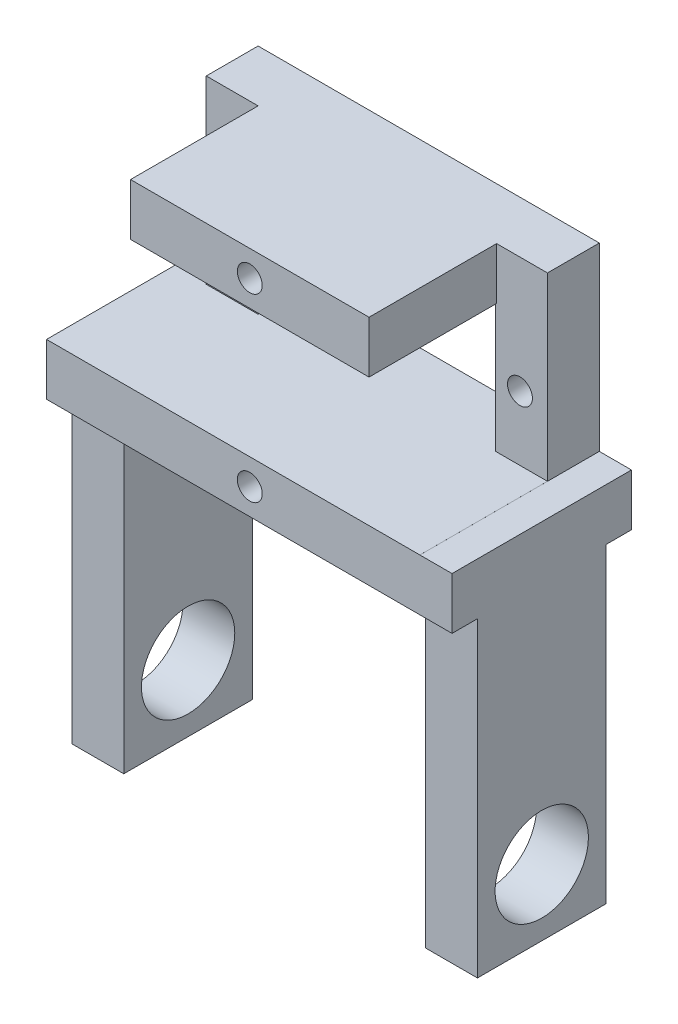
ISO-10303-21;
HEADER;
FILE_DESCRIPTION(('STEP AP214'),'2;1');
FILE_NAME('part.step','',(''),(''),'','','');
FILE_SCHEMA(('AUTOMOTIVE_DESIGN { 1 0 10303 214 1 1 1 1 }'));
ENDSEC;
DATA;
#1=APPLICATION_CONTEXT('core data for automotive mechanical design processes');
#2=APPLICATION_PROTOCOL_DEFINITION('international standard','automotive_design',2000,#1);
#3=PRODUCT_CONTEXT('',#1,'mechanical');
#4=PRODUCT('Part','Part','',(#3));
#5=PRODUCT_RELATED_PRODUCT_CATEGORY('part','',(#4));
#6=PRODUCT_DEFINITION_FORMATION('','',#4);
#7=PRODUCT_DEFINITION_CONTEXT('part definition',#1,'design');
#8=PRODUCT_DEFINITION('design','',#6,#7);
#9=PRODUCT_DEFINITION_SHAPE('','',#8);
#10=(LENGTH_UNIT() NAMED_UNIT(*) SI_UNIT(.MILLI.,.METRE.));
#11=(NAMED_UNIT(*) PLANE_ANGLE_UNIT() SI_UNIT($,.RADIAN.));
#12=(NAMED_UNIT(*) SI_UNIT($,.STERADIAN.) SOLID_ANGLE_UNIT());
#13=UNCERTAINTY_MEASURE_WITH_UNIT(LENGTH_MEASURE(1.E-05),#10,'distance_accuracy_value','');
#14=(GEOMETRIC_REPRESENTATION_CONTEXT(3) GLOBAL_UNCERTAINTY_ASSIGNED_CONTEXT((#13)) GLOBAL_UNIT_ASSIGNED_CONTEXT((#10,
#11,#12)) REPRESENTATION_CONTEXT('',''));
#15=CARTESIAN_POINT('',(0.,0.,0.));
#16=DIRECTION('',(0.,0.,1.));
#17=DIRECTION('',(1.,0.,0.));
#18=AXIS2_PLACEMENT_3D('',#15,#16,#17);
#19=CARTESIAN_POINT('',(-16.45,-11.2,5.));
#20=DIRECTION('',(0.,1.,0.));
#21=DIRECTION('',(0.,0.,1.));
#22=AXIS2_PLACEMENT_3D('',#19,#20,#21);
#23=PLANE('',#22);
#24=DIRECTION('',(-1.,0.,0.));
#25=VECTOR('',#24,1.);
#26=CARTESIAN_POINT('',(14.55,-11.2,14.85));
#27=LINE('',#26,#25);
#28=CARTESIAN_POINT('',(19.55,-11.2,14.85));
#29=VERTEX_POINT('',#28);
#30=CARTESIAN_POINT('',(14.55,-11.2,14.85));
#31=VERTEX_POINT('',#30);
#32=EDGE_CURVE('E475',#29,#31,#27,.T.);
#33=ORIENTED_EDGE('',*,*,#32,.F.);
#34=DIRECTION('',(0.,0.,-1.));
#35=VECTOR('',#34,1.);
#36=CARTESIAN_POINT('',(19.55,-11.2,17.3));
#37=LINE('',#36,#35);
#38=CARTESIAN_POINT('',(19.55,-11.2,17.3));
#39=VERTEX_POINT('',#38);
#40=EDGE_CURVE('E224',#39,#29,#37,.T.);
#41=ORIENTED_EDGE('',*,*,#40,.F.);
#42=DIRECTION('',(1.,0.,0.));
#43=VECTOR('',#42,1.);
#44=CARTESIAN_POINT('',(-11.45,-11.2,17.3));
#45=LINE('',#44,#43);
#46=CARTESIAN_POINT('',(-19.55,-11.2,17.3));
#47=VERTEX_POINT('',#46);
#48=EDGE_CURVE('E310',#47,#39,#45,.T.);
#49=ORIENTED_EDGE('',*,*,#48,.F.);
#50=DIRECTION('',(0.,0.,1.));
#51=VECTOR('',#50,1.);
#52=CARTESIAN_POINT('',(-19.55,-11.2,0.));
#53=LINE('',#52,#51);
#54=CARTESIAN_POINT('',(-19.55,-11.2,14.85));
#55=VERTEX_POINT('',#54);
#56=EDGE_CURVE('E260',#55,#47,#53,.T.);
#57=ORIENTED_EDGE('',*,*,#56,.F.);
#58=DIRECTION('',(-1.,0.,0.));
#59=VECTOR('',#58,1.);
#60=CARTESIAN_POINT('',(-14.55,-11.2,14.85));
#61=LINE('',#60,#59);
#62=CARTESIAN_POINT('',(-14.55,-11.2,14.85));
#63=VERTEX_POINT('',#62);
#64=EDGE_CURVE('E61',#63,#55,#61,.T.);
#65=ORIENTED_EDGE('',*,*,#64,.F.);
#66=DIRECTION('',(0.,0.,1.));
#67=VECTOR('',#66,1.);
#68=CARTESIAN_POINT('',(-14.55,-11.2,2.45));
#69=LINE('',#68,#67);
#70=CARTESIAN_POINT('',(-14.55,-11.2,2.45));
#71=VERTEX_POINT('',#70);
#72=EDGE_CURVE('E228',#71,#63,#69,.T.);
#73=ORIENTED_EDGE('',*,*,#72,.F.);
#74=DIRECTION('',(1.,0.,0.));
#75=VECTOR('',#74,1.);
#76=CARTESIAN_POINT('',(-14.55,-11.2,2.45));
#77=LINE('',#76,#75);
#78=CARTESIAN_POINT('',(-19.55,-11.2,2.45));
#79=VERTEX_POINT('',#78);
#80=EDGE_CURVE('E225',#79,#71,#77,.T.);
#81=ORIENTED_EDGE('',*,*,#80,.F.);
#82=CARTESIAN_POINT('',(-19.55,-11.2,0.));
#83=VERTEX_POINT('',#82);
#84=EDGE_CURVE('E261',#83,#79,#53,.T.);
#85=ORIENTED_EDGE('',*,*,#84,.F.);
#86=DIRECTION('',(1.,0.,0.));
#87=VECTOR('',#86,1.);
#88=CARTESIAN_POINT('',(-16.45,-11.2,0.));
#89=LINE('',#88,#87);
#90=CARTESIAN_POINT('',(19.55,-11.2,0.));
#91=VERTEX_POINT('',#90);
#92=EDGE_CURVE('E390',#83,#91,#89,.T.);
#93=ORIENTED_EDGE('',*,*,#92,.T.);
#94=CARTESIAN_POINT('',(19.55,-11.2,2.45));
#95=VERTEX_POINT('',#94);
#96=EDGE_CURVE('E275',#95,#91,#37,.T.);
#97=ORIENTED_EDGE('',*,*,#96,.F.);
#98=DIRECTION('',(1.,0.,0.));
#99=VECTOR('',#98,1.);
#100=CARTESIAN_POINT('',(14.55,-11.2,2.45));
#101=LINE('',#100,#99);
#102=CARTESIAN_POINT('',(14.55,-11.2,2.45));
#103=VERTEX_POINT('',#102);
#104=EDGE_CURVE('E218',#103,#95,#101,.T.);
#105=ORIENTED_EDGE('',*,*,#104,.F.);
#106=DIRECTION('',(0.,0.,-1.));
#107=VECTOR('',#106,1.);
#108=CARTESIAN_POINT('',(14.55,-11.2,2.45));
#109=LINE('',#108,#107);
#110=EDGE_CURVE('E477',#31,#103,#109,.T.);
#111=ORIENTED_EDGE('',*,*,#110,.F.);
#112=EDGE_LOOP('',(#33,#41,#49,#57,#65,#73,#81,#85,#93,#97,#105,#111));
#113=FACE_BOUND('',#112,.T.);
#114=ADVANCED_FACE('F36',(#113),#23,.F.);
#115=CARTESIAN_POINT('',(-16.45,11.2,5.));
#116=DIRECTION('',(1.,0.,0.));
#117=DIRECTION('',(0.,1.,0.));
#118=AXIS2_PLACEMENT_3D('',#115,#116,#117);
#119=PLANE('',#118);
#120=DIRECTION('',(0.,0.,-1.));
#121=VECTOR('',#120,1.);
#122=CARTESIAN_POINT('',(-16.45,-6.2,0.));
#123=LINE('',#122,#121);
#124=CARTESIAN_POINT('',(-16.45,-6.20000000000001,5.));
#125=VERTEX_POINT('',#124);
#126=CARTESIAN_POINT('',(-16.45,-6.2,0.));
#127=VERTEX_POINT('',#126);
#128=EDGE_CURVE('E11',#125,#127,#123,.T.);
#129=ORIENTED_EDGE('',*,*,#128,.F.);
#130=DIRECTION('',(0.,-1.,0.));
#131=VECTOR('',#130,1.);
#132=CARTESIAN_POINT('',(-16.45,11.2,5.));
#133=LINE('',#132,#131);
#134=CARTESIAN_POINT('',(-16.45,11.2,5.));
#135=VERTEX_POINT('',#134);
#136=EDGE_CURVE('E393',#135,#125,#133,.T.);
#137=ORIENTED_EDGE('',*,*,#136,.F.);
#138=DIRECTION('',(0.,0.,-1.));
#139=VECTOR('',#138,1.);
#140=CARTESIAN_POINT('',(-16.45,11.2,5.));
#141=LINE('',#140,#139);
#142=CARTESIAN_POINT('',(-16.45,11.2,0.));
#143=VERTEX_POINT('',#142);
#144=EDGE_CURVE('E396',#135,#143,#141,.T.);
#145=ORIENTED_EDGE('',*,*,#144,.T.);
#146=DIRECTION('',(0.,-1.,0.));
#147=VECTOR('',#146,1.);
#148=CARTESIAN_POINT('',(-16.45,11.2,0.));
#149=LINE('',#148,#147);
#150=EDGE_CURVE('E400',#143,#127,#149,.T.);
#151=ORIENTED_EDGE('',*,*,#150,.T.);
#152=EDGE_LOOP('',(#129,#137,#145,#151));
#153=FACE_BOUND('',#152,.T.);
#154=ADVANCED_FACE('F423',(#153),#119,.F.);
#155=CARTESIAN_POINT('',(16.45,11.2,5.));
#156=DIRECTION('',(-1.,0.,0.));
#157=DIRECTION('',(0.,0.,1.));
#158=AXIS2_PLACEMENT_3D('',#155,#156,#157);
#159=PLANE('',#158);
#160=DIRECTION('',(0.,0.,1.));
#161=VECTOR('',#160,1.);
#162=CARTESIAN_POINT('',(16.45,-6.20179511261654,17.3));
#163=LINE('',#162,#161);
#164=CARTESIAN_POINT('',(16.45,-6.20179511261654,0.));
#165=VERTEX_POINT('',#164);
#166=CARTESIAN_POINT('',(16.45,-6.20179511261654,17.3));
#167=VERTEX_POINT('',#166);
#168=EDGE_CURVE('E272',#165,#167,#163,.T.);
#169=ORIENTED_EDGE('',*,*,#168,.F.);
#170=DIRECTION('',(0.,1.,0.));
#171=VECTOR('',#170,1.);
#172=CARTESIAN_POINT('',(16.45,11.2,0.));
#173=LINE('',#172,#171);
#174=CARTESIAN_POINT('',(16.45,11.2,0.));
#175=VERTEX_POINT('',#174);
#176=EDGE_CURVE('E379',#165,#175,#173,.T.);
#177=ORIENTED_EDGE('',*,*,#176,.T.);
#178=DIRECTION('',(0.,0.,-1.));
#179=VECTOR('',#178,1.);
#180=CARTESIAN_POINT('',(16.45,11.2,5.));
#181=LINE('',#180,#179);
#182=CARTESIAN_POINT('',(16.45,11.2,5.));
#183=VERTEX_POINT('',#182);
#184=EDGE_CURVE('E331',#183,#175,#181,.T.);
#185=ORIENTED_EDGE('',*,*,#184,.F.);
#186=DIRECTION('',(0.,1.,0.));
#187=VECTOR('',#186,1.);
#188=CARTESIAN_POINT('',(16.45,11.2,5.));
#189=LINE('',#188,#187);
#190=CARTESIAN_POINT('',(16.45,-6.2,5.));
#191=VERTEX_POINT('',#190);
#192=EDGE_CURVE('E387',#191,#183,#189,.T.);
#193=ORIENTED_EDGE('',*,*,#192,.F.);
#194=DIRECTION('',(0.,0.,-1.));
#195=VECTOR('',#194,1.);
#196=CARTESIAN_POINT('',(16.45,-6.2,17.3));
#197=LINE('',#196,#195);
#198=CARTESIAN_POINT('',(16.45,-6.2,17.3));
#199=VERTEX_POINT('',#198);
#200=EDGE_CURVE('E291',#199,#191,#197,.T.);
#201=ORIENTED_EDGE('',*,*,#200,.F.);
#202=DIRECTION('',(0.,1.,0.));
#203=VECTOR('',#202,1.);
#204=CARTESIAN_POINT('',(16.45,-11.2,17.3));
#205=LINE('',#204,#203);
#206=EDGE_CURVE('E289',#167,#199,#205,.T.);
#207=ORIENTED_EDGE('',*,*,#206,.F.);
#208=EDGE_LOOP('',(#169,#177,#185,#193,#201,#207));
#209=FACE_BOUND('',#208,.T.);
#210=ADVANCED_FACE('F38',(#209),#159,.F.);
#211=CARTESIAN_POINT('',(0.,0.,5.));
#212=DIRECTION('',(0.,0.,1.));
#213=DIRECTION('',(1.,0.,0.));
#214=AXIS2_PLACEMENT_3D('',#211,#212,#213);
#215=PLANE('',#214);
#216=CARTESIAN_POINT('',(13.8,0.,5.));
#217=DIRECTION('',(0.,0.,1.));
#218=DIRECTION('',(1.,0.,0.));
#219=AXIS2_PLACEMENT_3D('',#216,#217,#218);
#220=CIRCLE('',#219,1.2);
#221=CARTESIAN_POINT('',(15.,0.,5.));
#222=VERTEX_POINT('',#221);
#223=EDGE_CURVE('E350',#222,#222,#220,.T.);
#224=ORIENTED_EDGE('',*,*,#223,.F.);
#225=EDGE_LOOP('',(#224));
#226=FACE_BOUND('',#225,.T.);
#227=DIRECTION('',(-1.,0.,0.));
#228=VECTOR('',#227,1.);
#229=CARTESIAN_POINT('',(-11.45,-6.2,5.));
#230=LINE('',#229,#228);
#231=CARTESIAN_POINT('',(11.45,-6.2,5.));
#232=VERTEX_POINT('',#231);
#233=EDGE_CURVE('E301',#191,#232,#230,.T.);
#234=ORIENTED_EDGE('',*,*,#233,.F.);
#235=ORIENTED_EDGE('',*,*,#192,.T.);
#236=DIRECTION('',(-1.,0.,0.));
#237=VECTOR('',#236,1.);
#238=CARTESIAN_POINT('',(-16.45,11.2,5.));
#239=LINE('',#238,#237);
#240=CARTESIAN_POINT('',(11.546888994161,11.2,5.));
#241=VERTEX_POINT('',#240);
#242=EDGE_CURVE('E391',#183,#241,#239,.T.);
#243=ORIENTED_EDGE('',*,*,#242,.T.);
#244=DIRECTION('',(0.,1.,0.));
#245=VECTOR('',#244,1.);
#246=CARTESIAN_POINT('',(11.546888994161,6.2,5.));
#247=LINE('',#246,#245);
#248=CARTESIAN_POINT('',(11.546888994161,6.2,5.));
#249=VERTEX_POINT('',#248);
#250=EDGE_CURVE('E320',#249,#241,#247,.T.);
#251=ORIENTED_EDGE('',*,*,#250,.F.);
#252=DIRECTION('',(1.,0.,0.));
#253=VECTOR('',#252,1.);
#254=CARTESIAN_POINT('',(-11.45,6.2,5.));
#255=LINE('',#254,#253);
#256=CARTESIAN_POINT('',(11.45,6.2,5.));
#257=VERTEX_POINT('',#256);
#258=EDGE_CURVE('E45',#257,#249,#255,.T.);
#259=ORIENTED_EDGE('',*,*,#258,.F.);
#260=DIRECTION('',(0.,1.,0.));
#261=VECTOR('',#260,1.);
#262=CARTESIAN_POINT('',(11.45,6.2,5.));
#263=LINE('',#262,#261);
#264=EDGE_CURVE('E349',#232,#257,#263,.T.);
#265=ORIENTED_EDGE('',*,*,#264,.F.);
#266=EDGE_LOOP('',(#234,#235,#243,#251,#259,#265));
#267=FACE_BOUND('',#266,.T.);
#268=ADVANCED_FACE('F447',(#226,#267),#215,.T.);
#269=CARTESIAN_POINT('',(-13.8,0.,5.));
#270=DIRECTION('',(0.,0.,1.));
#271=DIRECTION('',(1.,0.,0.));
#272=AXIS2_PLACEMENT_3D('',#269,#270,#271);
#273=CIRCLE('',#272,1.2);
#274=CARTESIAN_POINT('',(-12.6,0.,5.));
#275=VERTEX_POINT('',#274);
#276=EDGE_CURVE('E345',#275,#275,#273,.T.);
#277=ORIENTED_EDGE('',*,*,#276,.F.);
#278=EDGE_LOOP('',(#277));
#279=FACE_BOUND('',#278,.T.);
#280=ORIENTED_EDGE('',*,*,#136,.T.);
#281=DIRECTION('',(-1.,0.,0.));
#282=VECTOR('',#281,1.);
#283=CARTESIAN_POINT('',(-16.45,-6.20000000000001,5.));
#284=LINE('',#283,#282);
#285=CARTESIAN_POINT('',(-11.45,-6.20000000000001,5.));
#286=VERTEX_POINT('',#285);
#287=EDGE_CURVE('E294',#286,#125,#284,.T.);
#288=ORIENTED_EDGE('',*,*,#287,.F.);
#289=DIRECTION('',(0.,-1.,0.));
#290=VECTOR('',#289,1.);
#291=CARTESIAN_POINT('',(-11.45,6.2,5.));
#292=LINE('',#291,#290);
#293=CARTESIAN_POINT('',(-11.45,6.2,5.));
#294=VERTEX_POINT('',#293);
#295=EDGE_CURVE('E362',#294,#286,#292,.T.);
#296=ORIENTED_EDGE('',*,*,#295,.F.);
#297=DIRECTION('',(0.,-1.,0.));
#298=VECTOR('',#297,1.);
#299=CARTESIAN_POINT('',(-11.45,6.2,5.));
#300=LINE('',#299,#298);
#301=CARTESIAN_POINT('',(-11.45,11.2,5.));
#302=VERTEX_POINT('',#301);
#303=EDGE_CURVE('E314',#302,#294,#300,.T.);
#304=ORIENTED_EDGE('',*,*,#303,.F.);
#305=EDGE_CURVE('E389',#302,#135,#239,.T.);
#306=ORIENTED_EDGE('',*,*,#305,.T.);
#307=EDGE_LOOP('',(#280,#288,#296,#304,#306));
#308=FACE_BOUND('',#307,.T.);
#309=ADVANCED_FACE('F431',(#279,#308),#215,.T.);
#310=CARTESIAN_POINT('',(-16.45,11.2,5.));
#311=DIRECTION('',(0.,-1.,0.));
#312=DIRECTION('',(0.,0.,-1.));
#313=AXIS2_PLACEMENT_3D('',#310,#311,#312);
#314=PLANE('',#313);
#315=DIRECTION('',(-1.,0.,0.));
#316=VECTOR('',#315,1.);
#317=CARTESIAN_POINT('',(-16.45,11.2,0.));
#318=LINE('',#317,#316);
#319=EDGE_CURVE('E398',#175,#143,#318,.T.);
#320=ORIENTED_EDGE('',*,*,#319,.T.);
#321=ORIENTED_EDGE('',*,*,#144,.F.);
#322=ORIENTED_EDGE('',*,*,#305,.F.);
#323=DIRECTION('',(0.,0.,-1.));
#324=VECTOR('',#323,1.);
#325=CARTESIAN_POINT('',(-11.45,11.2,17.3));
#326=LINE('',#325,#324);
#327=CARTESIAN_POINT('',(-11.45,11.2,17.3));
#328=VERTEX_POINT('',#327);
#329=EDGE_CURVE('E326',#328,#302,#326,.T.);
#330=ORIENTED_EDGE('',*,*,#329,.F.);
#331=DIRECTION('',(-1.,0.,0.));
#332=VECTOR('',#331,1.);
#333=CARTESIAN_POINT('',(-11.45,11.2,17.3));
#334=LINE('',#333,#332);
#335=CARTESIAN_POINT('',(11.546888994161,11.2,17.3));
#336=VERTEX_POINT('',#335);
#337=EDGE_CURVE('E324',#336,#328,#334,.T.);
#338=ORIENTED_EDGE('',*,*,#337,.F.);
#339=DIRECTION('',(0.,0.,-1.));
#340=VECTOR('',#339,1.);
#341=CARTESIAN_POINT('',(11.546888994161,11.2,17.3));
#342=LINE('',#341,#340);
#343=EDGE_CURVE('E336',#336,#241,#342,.T.);
#344=ORIENTED_EDGE('',*,*,#343,.T.);
#345=ORIENTED_EDGE('',*,*,#242,.F.);
#346=ORIENTED_EDGE('',*,*,#184,.T.);
#347=EDGE_LOOP('',(#320,#321,#322,#330,#338,#344,#345,#346));
#348=FACE_BOUND('',#347,.T.);
#349=ADVANCED_FACE('F409',(#348),#314,.F.);
#350=CARTESIAN_POINT('',(0.,0.,0.));
#351=DIRECTION('',(0.,0.,1.));
#352=DIRECTION('',(1.,0.,0.));
#353=AXIS2_PLACEMENT_3D('',#350,#351,#352);
#354=PLANE('',#353);
#355=CARTESIAN_POINT('',(-13.8,0.,0.));
#356=DIRECTION('',(0.,0.,1.));
#357=DIRECTION('',(1.,0.,0.));
#358=AXIS2_PLACEMENT_3D('',#355,#356,#357);
#359=CIRCLE('',#358,1.2);
#360=CARTESIAN_POINT('',(-12.6,0.,0.));
#361=VERTEX_POINT('',#360);
#362=EDGE_CURVE('E353',#361,#361,#359,.T.);
#363=ORIENTED_EDGE('',*,*,#362,.T.);
#364=EDGE_LOOP('',(#363));
#365=FACE_BOUND('',#364,.T.);
#366=CARTESIAN_POINT('',(13.8,0.,0.));
#367=DIRECTION('',(0.,0.,1.));
#368=DIRECTION('',(1.,0.,0.));
#369=AXIS2_PLACEMENT_3D('',#366,#367,#368);
#370=CIRCLE('',#369,1.2);
#371=CARTESIAN_POINT('',(15.,0.,0.));
#372=VERTEX_POINT('',#371);
#373=EDGE_CURVE('E346',#372,#372,#370,.T.);
#374=ORIENTED_EDGE('',*,*,#373,.T.);
#375=EDGE_LOOP('',(#374));
#376=FACE_BOUND('',#375,.T.);
#377=DIRECTION('',(1.,0.,0.));
#378=VECTOR('',#377,1.);
#379=CARTESIAN_POINT('',(-11.45,-6.2,0.));
#380=LINE('',#379,#378);
#381=CARTESIAN_POINT('',(-11.45,-6.2,0.));
#382=VERTEX_POINT('',#381);
#383=CARTESIAN_POINT('',(11.45,-6.2,0.));
#384=VERTEX_POINT('',#383);
#385=EDGE_CURVE('E368',#382,#384,#380,.T.);
#386=ORIENTED_EDGE('',*,*,#385,.T.);
#387=DIRECTION('',(0.,1.,0.));
#388=VECTOR('',#387,1.);
#389=CARTESIAN_POINT('',(11.45,6.2,0.));
#390=LINE('',#389,#388);
#391=CARTESIAN_POINT('',(11.45,6.2,0.));
#392=VERTEX_POINT('',#391);
#393=EDGE_CURVE('E358',#384,#392,#390,.T.);
#394=ORIENTED_EDGE('',*,*,#393,.T.);
#395=DIRECTION('',(-1.,0.,0.));
#396=VECTOR('',#395,1.);
#397=CARTESIAN_POINT('',(-11.45,6.2,0.));
#398=LINE('',#397,#396);
#399=CARTESIAN_POINT('',(-11.45,6.2,0.));
#400=VERTEX_POINT('',#399);
#401=EDGE_CURVE('E361',#392,#400,#398,.T.);
#402=ORIENTED_EDGE('',*,*,#401,.T.);
#403=DIRECTION('',(0.,-1.,0.));
#404=VECTOR('',#403,1.);
#405=CARTESIAN_POINT('',(-11.45,6.2,0.));
#406=LINE('',#405,#404);
#407=EDGE_CURVE('E365',#400,#382,#406,.T.);
#408=ORIENTED_EDGE('',*,*,#407,.T.);
#409=EDGE_LOOP('',(#386,#394,#402,#408));
#410=FACE_BOUND('',#409,.T.);
#411=ORIENTED_EDGE('',*,*,#176,.F.);
#412=DIRECTION('',(-1.,0.,0.));
#413=VECTOR('',#412,1.);
#414=CARTESIAN_POINT('',(19.55,-6.20179511261654,0.));
#415=LINE('',#414,#413);
#416=CARTESIAN_POINT('',(19.55,-6.20179511261654,0.));
#417=VERTEX_POINT('',#416);
#418=EDGE_CURVE('E286',#417,#165,#415,.T.);
#419=ORIENTED_EDGE('',*,*,#418,.F.);
#420=DIRECTION('',(0.,1.,0.));
#421=VECTOR('',#420,1.);
#422=CARTESIAN_POINT('',(19.55,-11.2,0.));
#423=LINE('',#422,#421);
#424=EDGE_CURVE('E277',#91,#417,#423,.T.);
#425=ORIENTED_EDGE('',*,*,#424,.F.);
#426=ORIENTED_EDGE('',*,*,#92,.F.);
#427=DIRECTION('',(0.,-1.,0.));
#428=VECTOR('',#427,1.);
#429=CARTESIAN_POINT('',(-19.55,-11.2,0.));
#430=LINE('',#429,#428);
#431=CARTESIAN_POINT('',(-19.55,-6.2,0.));
#432=VERTEX_POINT('',#431);
#433=EDGE_CURVE('E257',#432,#83,#430,.T.);
#434=ORIENTED_EDGE('',*,*,#433,.F.);
#435=DIRECTION('',(1.,0.,0.));
#436=VECTOR('',#435,1.);
#437=CARTESIAN_POINT('',(-19.55,-6.2,0.));
#438=LINE('',#437,#436);
#439=EDGE_CURVE('E268',#432,#127,#438,.T.);
#440=ORIENTED_EDGE('',*,*,#439,.T.);
#441=ORIENTED_EDGE('',*,*,#150,.F.);
#442=ORIENTED_EDGE('',*,*,#319,.F.);
#443=EDGE_LOOP('',(#411,#419,#425,#426,#434,#440,#441,#442));
#444=FACE_BOUND('',#443,.T.);
#445=ADVANCED_FACE('F419',(#365,#376,#410,#444),#354,.F.);
#446=CARTESIAN_POINT('',(11.45,6.2,0.));
#447=DIRECTION('',(1.,0.,0.));
#448=DIRECTION('',(0.,0.,-1.));
#449=AXIS2_PLACEMENT_3D('',#446,#447,#448);
#450=PLANE('',#449);
#451=ORIENTED_EDGE('',*,*,#264,.T.);
#452=DIRECTION('',(0.,0.,1.));
#453=VECTOR('',#452,1.);
#454=CARTESIAN_POINT('',(11.45,6.2,0.));
#455=LINE('',#454,#453);
#456=EDGE_CURVE('E371',#392,#257,#455,.T.);
#457=ORIENTED_EDGE('',*,*,#456,.F.);
#458=ORIENTED_EDGE('',*,*,#393,.F.);
#459=DIRECTION('',(0.,0.,1.));
#460=VECTOR('',#459,1.);
#461=CARTESIAN_POINT('',(11.45,-6.2,0.));
#462=LINE('',#461,#460);
#463=EDGE_CURVE('E376',#384,#232,#462,.T.);
#464=ORIENTED_EDGE('',*,*,#463,.T.);
#465=EDGE_LOOP('',(#451,#457,#458,#464));
#466=FACE_BOUND('',#465,.T.);
#467=ADVANCED_FACE('F455',(#466),#450,.F.);
#468=CARTESIAN_POINT('',(-11.45,-6.2,0.));
#469=DIRECTION('',(0.,-1.,0.));
#470=DIRECTION('',(0.,0.,-1.));
#471=AXIS2_PLACEMENT_3D('',#468,#469,#470);
#472=PLANE('',#471);
#473=DIRECTION('',(0.,0.,1.));
#474=VECTOR('',#473,1.);
#475=CARTESIAN_POINT('',(-11.45,-6.2,0.));
#476=LINE('',#475,#474);
#477=EDGE_CURVE('E380',#382,#286,#476,.T.);
#478=ORIENTED_EDGE('',*,*,#477,.T.);
#479=ORIENTED_EDGE('',*,*,#287,.T.);
#480=ORIENTED_EDGE('',*,*,#128,.T.);
#481=ORIENTED_EDGE('',*,*,#439,.F.);
#482=DIRECTION('',(0.,0.,-1.));
#483=VECTOR('',#482,1.);
#484=CARTESIAN_POINT('',(-19.55,-6.2,0.));
#485=LINE('',#484,#483);
#486=CARTESIAN_POINT('',(-19.55,-6.2,17.3));
#487=VERTEX_POINT('',#486);
#488=EDGE_CURVE('E267',#487,#432,#485,.T.);
#489=ORIENTED_EDGE('',*,*,#488,.F.);
#490=DIRECTION('',(-1.,0.,0.));
#491=VECTOR('',#490,1.);
#492=CARTESIAN_POINT('',(-11.45,-6.2,17.3));
#493=LINE('',#492,#491);
#494=EDGE_CURVE('E312',#199,#487,#493,.T.);
#495=ORIENTED_EDGE('',*,*,#494,.F.);
#496=ORIENTED_EDGE('',*,*,#200,.T.);
#497=ORIENTED_EDGE('',*,*,#233,.T.);
#498=ORIENTED_EDGE('',*,*,#463,.F.);
#499=ORIENTED_EDGE('',*,*,#385,.F.);
#500=EDGE_LOOP('',(#478,#479,#480,#481,#489,#495,#496,#497,#498,#499));
#501=FACE_BOUND('',#500,.T.);
#502=ADVANCED_FACE('F426',(#501),#472,.F.);
#503=CARTESIAN_POINT('',(-11.45,6.2,0.));
#504=DIRECTION('',(-1.,0.,0.));
#505=DIRECTION('',(0.,0.,1.));
#506=AXIS2_PLACEMENT_3D('',#503,#504,#505);
#507=PLANE('',#506);
#508=ORIENTED_EDGE('',*,*,#295,.T.);
#509=ORIENTED_EDGE('',*,*,#477,.F.);
#510=ORIENTED_EDGE('',*,*,#407,.F.);
#511=DIRECTION('',(0.,0.,1.));
#512=VECTOR('',#511,1.);
#513=CARTESIAN_POINT('',(-11.45,6.2,0.));
#514=LINE('',#513,#512);
#515=EDGE_CURVE('E383',#400,#294,#514,.T.);
#516=ORIENTED_EDGE('',*,*,#515,.T.);
#517=EDGE_LOOP('',(#508,#509,#510,#516));
#518=FACE_BOUND('',#517,.T.);
#519=ADVANCED_FACE('F552',(#518),#507,.F.);
#520=CARTESIAN_POINT('',(-11.45,6.2,0.));
#521=DIRECTION('',(0.,1.,0.));
#522=DIRECTION('',(0.,0.,1.));
#523=AXIS2_PLACEMENT_3D('',#520,#521,#522);
#524=PLANE('',#523);
#525=ORIENTED_EDGE('',*,*,#456,.T.);
#526=ORIENTED_EDGE('',*,*,#258,.T.);
#527=DIRECTION('',(0.,0.,-1.));
#528=VECTOR('',#527,1.);
#529=CARTESIAN_POINT('',(11.546888994161,6.2,17.3));
#530=LINE('',#529,#528);
#531=CARTESIAN_POINT('',(11.546888994161,6.2,17.3));
#532=VERTEX_POINT('',#531);
#533=EDGE_CURVE('E339',#532,#249,#530,.T.);
#534=ORIENTED_EDGE('',*,*,#533,.F.);
#535=DIRECTION('',(1.,0.,0.));
#536=VECTOR('',#535,1.);
#537=CARTESIAN_POINT('',(-11.45,6.2,17.3));
#538=LINE('',#537,#536);
#539=CARTESIAN_POINT('',(-11.45,6.2,17.3));
#540=VERTEX_POINT('',#539);
#541=EDGE_CURVE('E319',#540,#532,#538,.T.);
#542=ORIENTED_EDGE('',*,*,#541,.F.);
#543=DIRECTION('',(0.,0.,-1.));
#544=VECTOR('',#543,1.);
#545=CARTESIAN_POINT('',(-11.45,6.2,17.3));
#546=LINE('',#545,#544);
#547=EDGE_CURVE('E342',#540,#294,#546,.T.);
#548=ORIENTED_EDGE('',*,*,#547,.T.);
#549=ORIENTED_EDGE('',*,*,#515,.F.);
#550=ORIENTED_EDGE('',*,*,#401,.F.);
#551=EDGE_LOOP('',(#525,#526,#534,#542,#548,#549,#550));
#552=FACE_BOUND('',#551,.T.);
#553=ADVANCED_FACE('F450',(#552),#524,.F.);
#554=CARTESIAN_POINT('',(13.8,0.,0.));
#555=DIRECTION('',(0.,0.,1.));
#556=DIRECTION('',(1.,0.,0.));
#557=AXIS2_PLACEMENT_3D('',#554,#555,#556);
#558=CYLINDRICAL_SURFACE('',#557,1.2);
#559=ORIENTED_EDGE('',*,*,#373,.F.);
#560=EDGE_LOOP('',(#559));
#561=FACE_BOUND('',#560,.T.);
#562=ORIENTED_EDGE('',*,*,#223,.T.);
#563=EDGE_LOOP('',(#562));
#564=FACE_BOUND('',#563,.T.);
#565=ADVANCED_FACE('F551',(#561,#564),#558,.F.);
#566=CARTESIAN_POINT('',(-13.8,0.,0.));
#567=DIRECTION('',(0.,0.,1.));
#568=DIRECTION('',(1.,0.,0.));
#569=AXIS2_PLACEMENT_3D('',#566,#567,#568);
#570=CYLINDRICAL_SURFACE('',#569,1.2);
#571=ORIENTED_EDGE('',*,*,#362,.F.);
#572=EDGE_LOOP('',(#571));
#573=FACE_BOUND('',#572,.T.);
#574=ORIENTED_EDGE('',*,*,#276,.T.);
#575=EDGE_LOOP('',(#574));
#576=FACE_BOUND('',#575,.T.);
#577=ADVANCED_FACE('F558',(#573,#576),#570,.F.);
#578=CARTESIAN_POINT('',(-11.45,6.2,17.3));
#579=DIRECTION('',(1.,0.,0.));
#580=DIRECTION('',(0.,0.,-1.));
#581=AXIS2_PLACEMENT_3D('',#578,#579,#580);
#582=PLANE('',#581);
#583=ORIENTED_EDGE('',*,*,#303,.T.);
#584=ORIENTED_EDGE('',*,*,#547,.F.);
#585=DIRECTION('',(0.,-1.,0.));
#586=VECTOR('',#585,1.);
#587=CARTESIAN_POINT('',(-11.45,6.2,17.3));
#588=LINE('',#587,#586);
#589=EDGE_CURVE('E316',#328,#540,#588,.T.);
#590=ORIENTED_EDGE('',*,*,#589,.F.);
#591=ORIENTED_EDGE('',*,*,#329,.T.);
#592=EDGE_LOOP('',(#583,#584,#590,#591));
#593=FACE_BOUND('',#592,.T.);
#594=ADVANCED_FACE('F437',(#593),#582,.F.);
#595=CARTESIAN_POINT('',(11.546888994161,6.2,17.3));
#596=DIRECTION('',(-1.,0.,0.));
#597=DIRECTION('',(0.,0.,1.));
#598=AXIS2_PLACEMENT_3D('',#595,#596,#597);
#599=PLANE('',#598);
#600=ORIENTED_EDGE('',*,*,#250,.T.);
#601=ORIENTED_EDGE('',*,*,#343,.F.);
#602=DIRECTION('',(0.,1.,0.));
#603=VECTOR('',#602,1.);
#604=CARTESIAN_POINT('',(11.546888994161,6.2,17.3));
#605=LINE('',#604,#603);
#606=EDGE_CURVE('E322',#532,#336,#605,.T.);
#607=ORIENTED_EDGE('',*,*,#606,.F.);
#608=ORIENTED_EDGE('',*,*,#533,.T.);
#609=EDGE_LOOP('',(#600,#601,#607,#608));
#610=FACE_BOUND('',#609,.T.);
#611=ADVANCED_FACE('F445',(#610),#599,.F.);
#612=CARTESIAN_POINT('',(0.,0.,17.3));
#613=DIRECTION('',(0.,0.,-1.));
#614=DIRECTION('',(-1.,0.,0.));
#615=AXIS2_PLACEMENT_3D('',#612,#613,#614);
#616=PLANE('',#615);
#617=CARTESIAN_POINT('',(0.0484444970805025,8.7,17.3));
#618=DIRECTION('',(0.,0.,1.));
#619=DIRECTION('',(1.,0.,0.));
#620=AXIS2_PLACEMENT_3D('',#617,#618,#619);
#621=CIRCLE('',#620,1.2);
#622=CARTESIAN_POINT('',(1.2484444970805,8.7,17.3));
#623=VERTEX_POINT('',#622);
#624=EDGE_CURVE('E302',#623,#623,#621,.T.);
#625=ORIENTED_EDGE('',*,*,#624,.F.);
#626=EDGE_LOOP('',(#625));
#627=FACE_BOUND('',#626,.T.);
#628=ORIENTED_EDGE('',*,*,#589,.T.);
#629=ORIENTED_EDGE('',*,*,#541,.T.);
#630=ORIENTED_EDGE('',*,*,#606,.T.);
#631=ORIENTED_EDGE('',*,*,#337,.T.);
#632=EDGE_LOOP('',(#628,#629,#630,#631));
#633=FACE_BOUND('',#632,.T.);
#634=ADVANCED_FACE('F440',(#627,#633),#616,.F.);
#635=CARTESIAN_POINT('',(0.,0.,17.3));
#636=DIRECTION('',(0.,0.,1.));
#637=DIRECTION('',(1.,0.,0.));
#638=AXIS2_PLACEMENT_3D('',#635,#636,#637);
#639=PLANE('',#638);
#640=CARTESIAN_POINT('',(0.0484444970805025,-8.7,17.3));
#641=DIRECTION('',(0.,0.,1.));
#642=DIRECTION('',(1.,0.,0.));
#643=AXIS2_PLACEMENT_3D('',#640,#641,#642);
#644=CIRCLE('',#643,1.2);
#645=CARTESIAN_POINT('',(1.2484444970805,-8.7,17.3));
#646=VERTEX_POINT('',#645);
#647=EDGE_CURVE('E297',#646,#646,#644,.T.);
#648=ORIENTED_EDGE('',*,*,#647,.F.);
#649=EDGE_LOOP('',(#648));
#650=FACE_BOUND('',#649,.T.);
#651=ORIENTED_EDGE('',*,*,#494,.T.);
#652=DIRECTION('',(0.,1.,0.));
#653=VECTOR('',#652,1.);
#654=CARTESIAN_POINT('',(-19.55,-11.2,17.3));
#655=LINE('',#654,#653);
#656=EDGE_CURVE('E264',#47,#487,#655,.T.);
#657=ORIENTED_EDGE('',*,*,#656,.F.);
#658=ORIENTED_EDGE('',*,*,#48,.T.);
#659=DIRECTION('',(0.,-1.,0.));
#660=VECTOR('',#659,1.);
#661=CARTESIAN_POINT('',(19.55,-11.2,17.3));
#662=LINE('',#661,#660);
#663=CARTESIAN_POINT('',(19.55,-6.20179511261654,17.3));
#664=VERTEX_POINT('',#663);
#665=EDGE_CURVE('E273',#664,#39,#662,.T.);
#666=ORIENTED_EDGE('',*,*,#665,.F.);
#667=DIRECTION('',(-1.,0.,0.));
#668=VECTOR('',#667,1.);
#669=CARTESIAN_POINT('',(19.55,-6.20179511261654,17.3));
#670=LINE('',#669,#668);
#671=EDGE_CURVE('E281',#664,#167,#670,.T.);
#672=ORIENTED_EDGE('',*,*,#671,.T.);
#673=ORIENTED_EDGE('',*,*,#206,.T.);
#674=EDGE_LOOP('',(#651,#657,#658,#666,#672,#673));
#675=FACE_BOUND('',#674,.T.);
#676=ADVANCED_FACE('F463',(#650,#675),#639,.T.);
#677=CARTESIAN_POINT('',(0.0484444970805025,-8.7,12.3));
#678=DIRECTION('',(0.,0.,1.));
#679=DIRECTION('',(1.,0.,0.));
#680=AXIS2_PLACEMENT_3D('',#677,#678,#679);
#681=CYLINDRICAL_SURFACE('',#680,1.2);
#682=CARTESIAN_POINT('',(0.0484444970805025,-8.7,12.3));
#683=DIRECTION('',(0.,0.,1.));
#684=DIRECTION('',(1.,0.,0.));
#685=AXIS2_PLACEMENT_3D('',#682,#683,#684);
#686=CIRCLE('',#685,1.2);
#687=CARTESIAN_POINT('',(1.2484444970805,-8.7,12.3));
#688=VERTEX_POINT('',#687);
#689=EDGE_CURVE('E305',#688,#688,#686,.T.);
#690=ORIENTED_EDGE('',*,*,#689,.F.);
#691=EDGE_LOOP('',(#690));
#692=FACE_BOUND('',#691,.T.);
#693=ORIENTED_EDGE('',*,*,#647,.T.);
#694=EDGE_LOOP('',(#693));
#695=FACE_BOUND('',#694,.T.);
#696=ADVANCED_FACE('F574',(#692,#695),#681,.F.);
#697=CARTESIAN_POINT('',(0.0484444970805025,-8.7,12.3));
#698=DIRECTION('',(0.,0.,1.));
#699=DIRECTION('',(1.,0.,0.));
#700=AXIS2_PLACEMENT_3D('',#697,#698,#699);
#701=PLANE('',#700);
#702=ORIENTED_EDGE('',*,*,#689,.T.);
#703=EDGE_LOOP('',(#702));
#704=FACE_BOUND('',#703,.T.);
#705=ADVANCED_FACE('F578',(#704),#701,.T.);
#706=CARTESIAN_POINT('',(0.0484444970805025,8.7,12.3));
#707=DIRECTION('',(0.,0.,1.));
#708=DIRECTION('',(1.,0.,0.));
#709=AXIS2_PLACEMENT_3D('',#706,#707,#708);
#710=CYLINDRICAL_SURFACE('',#709,1.2);
#711=CARTESIAN_POINT('',(0.0484444970805025,8.7,12.3));
#712=DIRECTION('',(0.,0.,1.));
#713=DIRECTION('',(1.,0.,0.));
#714=AXIS2_PLACEMENT_3D('',#711,#712,#713);
#715=CIRCLE('',#714,1.2);
#716=CARTESIAN_POINT('',(1.2484444970805,8.7,12.3));
#717=VERTEX_POINT('',#716);
#718=EDGE_CURVE('E298',#717,#717,#715,.T.);
#719=ORIENTED_EDGE('',*,*,#718,.F.);
#720=EDGE_LOOP('',(#719));
#721=FACE_BOUND('',#720,.T.);
#722=ORIENTED_EDGE('',*,*,#624,.T.);
#723=EDGE_LOOP('',(#722));
#724=FACE_BOUND('',#723,.T.);
#725=ADVANCED_FACE('F582',(#721,#724),#710,.F.);
#726=CARTESIAN_POINT('',(0.0484444970805025,8.7,12.3));
#727=DIRECTION('',(0.,0.,1.));
#728=DIRECTION('',(1.,0.,0.));
#729=AXIS2_PLACEMENT_3D('',#726,#727,#728);
#730=PLANE('',#729);
#731=ORIENTED_EDGE('',*,*,#718,.T.);
#732=EDGE_LOOP('',(#731));
#733=FACE_BOUND('',#732,.T.);
#734=ADVANCED_FACE('F586',(#733),#730,.T.);
#735=CARTESIAN_POINT('',(19.55,-6.20179511261654,17.3));
#736=DIRECTION('',(0.,-1.,0.));
#737=DIRECTION('',(1.,0.,0.));
#738=AXIS2_PLACEMENT_3D('',#735,#736,#737);
#739=PLANE('',#738);
#740=ORIENTED_EDGE('',*,*,#168,.T.);
#741=ORIENTED_EDGE('',*,*,#671,.F.);
#742=DIRECTION('',(0.,0.,1.));
#743=VECTOR('',#742,1.);
#744=CARTESIAN_POINT('',(19.55,-6.20179511261654,17.3));
#745=LINE('',#744,#743);
#746=EDGE_CURVE('E279',#417,#664,#745,.T.);
#747=ORIENTED_EDGE('',*,*,#746,.F.);
#748=ORIENTED_EDGE('',*,*,#418,.T.);
#749=EDGE_LOOP('',(#740,#741,#747,#748));
#750=FACE_BOUND('',#749,.T.);
#751=ADVANCED_FACE('F460',(#750),#739,.F.);
#752=CARTESIAN_POINT('',(19.55,0.,0.));
#753=DIRECTION('',(-1.,0.,0.));
#754=DIRECTION('',(0.,0.,1.));
#755=AXIS2_PLACEMENT_3D('',#752,#753,#754);
#756=PLANE('',#755);
#757=CARTESIAN_POINT('',(19.55,-34.8,8.65));
#758=DIRECTION('',(1.,0.,0.));
#759=DIRECTION('',(0.,0.,-1.));
#760=AXIS2_PLACEMENT_3D('',#757,#758,#759);
#761=CIRCLE('',#760,4.5);
#762=CARTESIAN_POINT('',(19.55,-34.8,4.15));
#763=VERTEX_POINT('',#762);
#764=EDGE_CURVE('E481',#763,#763,#761,.T.);
#765=ORIENTED_EDGE('',*,*,#764,.F.);
#766=EDGE_LOOP('',(#765));
#767=FACE_BOUND('',#766,.T.);
#768=DIRECTION('',(0.,1.,0.));
#769=VECTOR('',#768,1.);
#770=CARTESIAN_POINT('',(19.55,-41.2,2.45));
#771=LINE('',#770,#769);
#772=CARTESIAN_POINT('',(19.55,-41.2,2.45));
#773=VERTEX_POINT('',#772);
#774=EDGE_CURVE('E53',#773,#95,#771,.T.);
#775=ORIENTED_EDGE('',*,*,#774,.T.);
#776=ORIENTED_EDGE('',*,*,#96,.T.);
#777=ORIENTED_EDGE('',*,*,#424,.T.);
#778=ORIENTED_EDGE('',*,*,#746,.T.);
#779=ORIENTED_EDGE('',*,*,#665,.T.);
#780=ORIENTED_EDGE('',*,*,#40,.T.);
#781=DIRECTION('',(0.,1.,0.));
#782=VECTOR('',#781,1.);
#783=CARTESIAN_POINT('',(19.55,-41.2,14.85));
#784=LINE('',#783,#782);
#785=CARTESIAN_POINT('',(19.55,-41.2,14.85));
#786=VERTEX_POINT('',#785);
#787=EDGE_CURVE('E206',#786,#29,#784,.T.);
#788=ORIENTED_EDGE('',*,*,#787,.F.);
#789=DIRECTION('',(0.,0.,1.));
#790=VECTOR('',#789,1.);
#791=CARTESIAN_POINT('',(19.55,-41.2,2.45));
#792=LINE('',#791,#790);
#793=EDGE_CURVE('E213',#773,#786,#792,.T.);
#794=ORIENTED_EDGE('',*,*,#793,.F.);
#795=EDGE_LOOP('',(#775,#776,#777,#778,#779,#780,#788,#794));
#796=FACE_BOUND('',#795,.T.);
#797=ADVANCED_FACE('F221',(#767,#796),#756,.F.);
#798=CARTESIAN_POINT('',(-19.55,0.,0.));
#799=DIRECTION('',(1.,0.,0.));
#800=DIRECTION('',(0.,0.,-1.));
#801=AXIS2_PLACEMENT_3D('',#798,#799,#800);
#802=PLANE('',#801);
#803=CARTESIAN_POINT('',(-19.55,-34.8,8.65));
#804=DIRECTION('',(1.,0.,0.));
#805=DIRECTION('',(0.,0.,-1.));
#806=AXIS2_PLACEMENT_3D('',#803,#804,#805);
#807=CIRCLE('',#806,4.5);
#808=CARTESIAN_POINT('',(-19.55,-34.8,4.15));
#809=VERTEX_POINT('',#808);
#810=EDGE_CURVE('E495',#809,#809,#807,.T.);
#811=ORIENTED_EDGE('',*,*,#810,.T.);
#812=EDGE_LOOP('',(#811));
#813=FACE_BOUND('',#812,.T.);
#814=ORIENTED_EDGE('',*,*,#84,.T.);
#815=DIRECTION('',(0.,1.,0.));
#816=VECTOR('',#815,1.);
#817=CARTESIAN_POINT('',(-19.55,-41.2,2.45));
#818=LINE('',#817,#816);
#819=CARTESIAN_POINT('',(-19.55,-41.2,2.45));
#820=VERTEX_POINT('',#819);
#821=EDGE_CURVE('E254',#820,#79,#818,.T.);
#822=ORIENTED_EDGE('',*,*,#821,.F.);
#823=DIRECTION('',(0.,0.,-1.));
#824=VECTOR('',#823,1.);
#825=CARTESIAN_POINT('',(-19.55,-41.2,2.45));
#826=LINE('',#825,#824);
#827=CARTESIAN_POINT('',(-19.55,-41.2,14.85));
#828=VERTEX_POINT('',#827);
#829=EDGE_CURVE('E234',#828,#820,#826,.T.);
#830=ORIENTED_EDGE('',*,*,#829,.F.);
#831=DIRECTION('',(0.,1.,0.));
#832=VECTOR('',#831,1.);
#833=CARTESIAN_POINT('',(-19.55,-41.2,14.85));
#834=LINE('',#833,#832);
#835=EDGE_CURVE('E242',#828,#55,#834,.T.);
#836=ORIENTED_EDGE('',*,*,#835,.T.);
#837=ORIENTED_EDGE('',*,*,#56,.T.);
#838=ORIENTED_EDGE('',*,*,#656,.T.);
#839=ORIENTED_EDGE('',*,*,#488,.T.);
#840=ORIENTED_EDGE('',*,*,#433,.T.);
#841=EDGE_LOOP('',(#814,#822,#830,#836,#837,#838,#839,#840));
#842=FACE_BOUND('',#841,.T.);
#843=ADVANCED_FACE('F471',(#813,#842),#802,.F.);
#844=CARTESIAN_POINT('',(-14.55,-41.2,2.45));
#845=DIRECTION('',(0.,0.,1.));
#846=DIRECTION('',(1.,0.,0.));
#847=AXIS2_PLACEMENT_3D('',#844,#845,#846);
#848=PLANE('',#847);
#849=ORIENTED_EDGE('',*,*,#80,.T.);
#850=DIRECTION('',(0.,1.,0.));
#851=VECTOR('',#850,1.);
#852=CARTESIAN_POINT('',(-14.55,-41.2,2.45));
#853=LINE('',#852,#851);
#854=CARTESIAN_POINT('',(-14.55,-41.2,2.45));
#855=VERTEX_POINT('',#854);
#856=EDGE_CURVE('E251',#855,#71,#853,.T.);
#857=ORIENTED_EDGE('',*,*,#856,.F.);
#858=DIRECTION('',(1.,0.,0.));
#859=VECTOR('',#858,1.);
#860=CARTESIAN_POINT('',(-14.55,-41.2,2.45));
#861=LINE('',#860,#859);
#862=EDGE_CURVE('E237',#820,#855,#861,.T.);
#863=ORIENTED_EDGE('',*,*,#862,.F.);
#864=ORIENTED_EDGE('',*,*,#821,.T.);
#865=EDGE_LOOP('',(#849,#857,#863,#864));
#866=FACE_BOUND('',#865,.T.);
#867=ADVANCED_FACE('F509',(#866),#848,.F.);
#868=CARTESIAN_POINT('',(-14.55,-41.2,2.45));
#869=DIRECTION('',(-1.,0.,0.));
#870=DIRECTION('',(0.,0.,1.));
#871=AXIS2_PLACEMENT_3D('',#868,#869,#870);
#872=PLANE('',#871);
#873=CARTESIAN_POINT('',(-14.55,-34.8,8.65));
#874=DIRECTION('',(1.,0.,0.));
#875=DIRECTION('',(0.,0.,-1.));
#876=AXIS2_PLACEMENT_3D('',#873,#874,#875);
#877=CIRCLE('',#876,4.5);
#878=CARTESIAN_POINT('',(-14.55,-34.8,4.15));
#879=VERTEX_POINT('',#878);
#880=EDGE_CURVE('E498',#879,#879,#877,.T.);
#881=ORIENTED_EDGE('',*,*,#880,.F.);
#882=EDGE_LOOP('',(#881));
#883=FACE_BOUND('',#882,.T.);
#884=ORIENTED_EDGE('',*,*,#72,.T.);
#885=DIRECTION('',(0.,1.,0.));
#886=VECTOR('',#885,1.);
#887=CARTESIAN_POINT('',(-14.55,-41.2,14.85));
#888=LINE('',#887,#886);
#889=CARTESIAN_POINT('',(-14.55,-41.2,14.85));
#890=VERTEX_POINT('',#889);
#891=EDGE_CURVE('E248',#890,#63,#888,.T.);
#892=ORIENTED_EDGE('',*,*,#891,.F.);
#893=DIRECTION('',(0.,0.,1.));
#894=VECTOR('',#893,1.);
#895=CARTESIAN_POINT('',(-14.55,-41.2,2.45));
#896=LINE('',#895,#894);
#897=EDGE_CURVE('E239',#855,#890,#896,.T.);
#898=ORIENTED_EDGE('',*,*,#897,.F.);
#899=ORIENTED_EDGE('',*,*,#856,.T.);
#900=EDGE_LOOP('',(#884,#892,#898,#899));
#901=FACE_BOUND('',#900,.T.);
#902=ADVANCED_FACE('F505',(#883,#901),#872,.F.);
#903=CARTESIAN_POINT('',(-14.55,-41.2,14.85));
#904=DIRECTION('',(0.,0.,-1.));
#905=DIRECTION('',(-1.,0.,0.));
#906=AXIS2_PLACEMENT_3D('',#903,#904,#905);
#907=PLANE('',#906);
#908=ORIENTED_EDGE('',*,*,#64,.T.);
#909=ORIENTED_EDGE('',*,*,#835,.F.);
#910=DIRECTION('',(-1.,0.,0.));
#911=VECTOR('',#910,1.);
#912=CARTESIAN_POINT('',(-14.55,-41.2,14.85));
#913=LINE('',#912,#911);
#914=EDGE_CURVE('E241',#890,#828,#913,.T.);
#915=ORIENTED_EDGE('',*,*,#914,.F.);
#916=ORIENTED_EDGE('',*,*,#891,.T.);
#917=EDGE_LOOP('',(#908,#909,#915,#916));
#918=FACE_BOUND('',#917,.T.);
#919=ADVANCED_FACE('F508',(#918),#907,.F.);
#920=CARTESIAN_POINT('',(0.,-41.2,0.));
#921=DIRECTION('',(0.,-1.,0.));
#922=DIRECTION('',(0.,0.,-1.));
#923=AXIS2_PLACEMENT_3D('',#920,#921,#922);
#924=PLANE('',#923);
#925=ORIENTED_EDGE('',*,*,#829,.T.);
#926=ORIENTED_EDGE('',*,*,#862,.T.);
#927=ORIENTED_EDGE('',*,*,#897,.T.);
#928=ORIENTED_EDGE('',*,*,#914,.T.);
#929=EDGE_LOOP('',(#925,#926,#927,#928));
#930=FACE_BOUND('',#929,.T.);
#931=ADVANCED_FACE('F517',(#930),#924,.T.);
#932=CARTESIAN_POINT('',(14.55,-41.2,14.85));
#933=DIRECTION('',(0.,0.,-1.));
#934=DIRECTION('',(-1.,0.,0.));
#935=AXIS2_PLACEMENT_3D('',#932,#933,#934);
#936=PLANE('',#935);
#937=ORIENTED_EDGE('',*,*,#32,.T.);
#938=DIRECTION('',(0.,1.,0.));
#939=VECTOR('',#938,1.);
#940=CARTESIAN_POINT('',(14.55,-41.2,14.85));
#941=LINE('',#940,#939);
#942=CARTESIAN_POINT('',(14.55,-41.2,14.85));
#943=VERTEX_POINT('',#942);
#944=EDGE_CURVE('E209',#943,#31,#941,.T.);
#945=ORIENTED_EDGE('',*,*,#944,.F.);
#946=DIRECTION('',(-1.,0.,0.));
#947=VECTOR('',#946,1.);
#948=CARTESIAN_POINT('',(14.55,-41.2,14.85));
#949=LINE('',#948,#947);
#950=EDGE_CURVE('E202',#786,#943,#949,.T.);
#951=ORIENTED_EDGE('',*,*,#950,.F.);
#952=ORIENTED_EDGE('',*,*,#787,.T.);
#953=EDGE_LOOP('',(#937,#945,#951,#952));
#954=FACE_BOUND('',#953,.T.);
#955=ADVANCED_FACE('F204',(#954),#936,.F.);
#956=CARTESIAN_POINT('',(14.55,-41.2,2.45));
#957=DIRECTION('',(1.,0.,0.));
#958=DIRECTION('',(0.,0.,-1.));
#959=AXIS2_PLACEMENT_3D('',#956,#957,#958);
#960=PLANE('',#959);
#961=CARTESIAN_POINT('',(14.55,-34.8,8.65));
#962=DIRECTION('',(1.,0.,0.));
#963=DIRECTION('',(0.,0.,-1.));
#964=AXIS2_PLACEMENT_3D('',#961,#962,#963);
#965=CIRCLE('',#964,4.5);
#966=CARTESIAN_POINT('',(14.55,-34.8,4.15));
#967=VERTEX_POINT('',#966);
#968=EDGE_CURVE('E40',#967,#967,#965,.T.);
#969=ORIENTED_EDGE('',*,*,#968,.T.);
#970=EDGE_LOOP('',(#969));
#971=FACE_BOUND('',#970,.T.);
#972=ORIENTED_EDGE('',*,*,#110,.T.);
#973=DIRECTION('',(0.,1.,0.));
#974=VECTOR('',#973,1.);
#975=CARTESIAN_POINT('',(14.55,-41.2,2.45));
#976=LINE('',#975,#974);
#977=CARTESIAN_POINT('',(14.55,-41.2,2.45));
#978=VERTEX_POINT('',#977);
#979=EDGE_CURVE('E230',#978,#103,#976,.T.);
#980=ORIENTED_EDGE('',*,*,#979,.F.);
#981=DIRECTION('',(0.,0.,-1.));
#982=VECTOR('',#981,1.);
#983=CARTESIAN_POINT('',(14.55,-41.2,2.45));
#984=LINE('',#983,#982);
#985=EDGE_CURVE('E212',#943,#978,#984,.T.);
#986=ORIENTED_EDGE('',*,*,#985,.F.);
#987=ORIENTED_EDGE('',*,*,#944,.T.);
#988=EDGE_LOOP('',(#972,#980,#986,#987));
#989=FACE_BOUND('',#988,.T.);
#990=ADVANCED_FACE('F491',(#971,#989),#960,.F.);
#991=CARTESIAN_POINT('',(14.55,-41.2,2.45));
#992=DIRECTION('',(0.,0.,1.));
#993=DIRECTION('',(1.,0.,0.));
#994=AXIS2_PLACEMENT_3D('',#991,#992,#993);
#995=PLANE('',#994);
#996=ORIENTED_EDGE('',*,*,#104,.T.);
#997=ORIENTED_EDGE('',*,*,#774,.F.);
#998=DIRECTION('',(1.,0.,0.));
#999=VECTOR('',#998,1.);
#1000=CARTESIAN_POINT('',(14.55,-41.2,2.45));
#1001=LINE('',#1000,#999);
#1002=EDGE_CURVE('E217',#978,#773,#1001,.T.);
#1003=ORIENTED_EDGE('',*,*,#1002,.F.);
#1004=ORIENTED_EDGE('',*,*,#979,.T.);
#1005=EDGE_LOOP('',(#996,#997,#1003,#1004));
#1006=FACE_BOUND('',#1005,.T.);
#1007=ADVANCED_FACE('F489',(#1006),#995,.F.);
#1008=CARTESIAN_POINT('',(0.,-41.2,0.));
#1009=DIRECTION('',(0.,1.,0.));
#1010=DIRECTION('',(0.,0.,1.));
#1011=AXIS2_PLACEMENT_3D('',#1008,#1009,#1010);
#1012=PLANE('',#1011);
#1013=ORIENTED_EDGE('',*,*,#793,.T.);
#1014=ORIENTED_EDGE('',*,*,#950,.T.);
#1015=ORIENTED_EDGE('',*,*,#985,.T.);
#1016=ORIENTED_EDGE('',*,*,#1002,.T.);
#1017=EDGE_LOOP('',(#1013,#1014,#1015,#1016));
#1018=FACE_BOUND('',#1017,.T.);
#1019=ADVANCED_FACE('F215',(#1018),#1012,.F.);
#1020=CARTESIAN_POINT('',(9.55,-34.8,8.65));
#1021=DIRECTION('',(1.,0.,0.));
#1022=DIRECTION('',(0.,0.,-1.));
#1023=AXIS2_PLACEMENT_3D('',#1020,#1021,#1022);
#1024=CYLINDRICAL_SURFACE('',#1023,4.5);
#1025=ORIENTED_EDGE('',*,*,#764,.T.);
#1026=EDGE_LOOP('',(#1025));
#1027=FACE_BOUND('',#1026,.T.);
#1028=ORIENTED_EDGE('',*,*,#968,.F.);
#1029=EDGE_LOOP('',(#1028));
#1030=FACE_BOUND('',#1029,.T.);
#1031=ADVANCED_FACE('F599',(#1027,#1030),#1024,.F.);
#1032=CARTESIAN_POINT('',(-24.55,-34.8,8.65));
#1033=DIRECTION('',(1.,0.,0.));
#1034=DIRECTION('',(0.,0.,-1.));
#1035=AXIS2_PLACEMENT_3D('',#1032,#1033,#1034);
#1036=CYLINDRICAL_SURFACE('',#1035,4.5);
#1037=ORIENTED_EDGE('',*,*,#880,.T.);
#1038=EDGE_LOOP('',(#1037));
#1039=FACE_BOUND('',#1038,.T.);
#1040=ORIENTED_EDGE('',*,*,#810,.F.);
#1041=EDGE_LOOP('',(#1040));
#1042=FACE_BOUND('',#1041,.T.);
#1043=ADVANCED_FACE('F502',(#1039,#1042),#1036,.F.);
#1044=CLOSED_SHELL('',(#114,#154,#210,#268,#309,#349,#445,#467,#502,#519,#553,#565,#577,#594,
#611,#634,#676,#696,#705,#725,#734,#751,#797,#843,#867,#902,#919,#931,#955,#990,#1007,#1019,
#1031,#1043));
#1045=MANIFOLD_SOLID_BREP('B2',#1044);
#1046=ADVANCED_BREP_SHAPE_REPRESENTATION('',(#18,#1045),#14);
#1047=SHAPE_DEFINITION_REPRESENTATION(#9,#1046);
ENDSEC;
END-ISO-10303-21;
